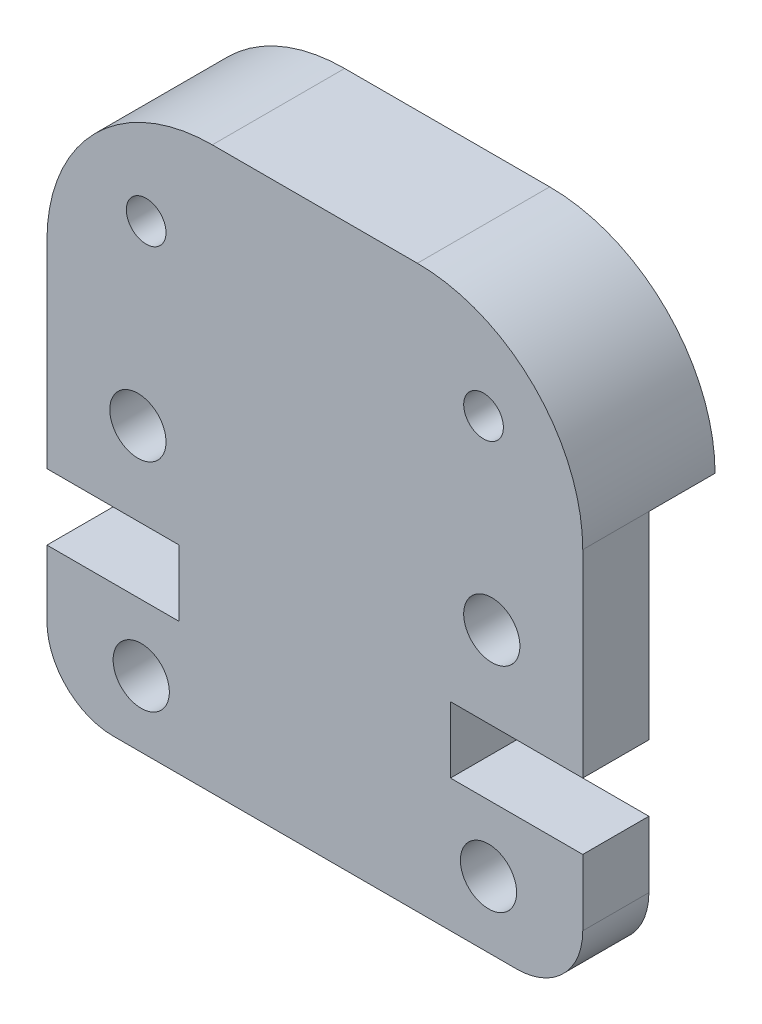
ISO-10303-21;
HEADER;
FILE_DESCRIPTION(('STEP AP214'),'2;1');
FILE_NAME('part.step','',(''),(''),'','','');
FILE_SCHEMA(('AUTOMOTIVE_DESIGN { 1 0 10303 214 1 1 1 1 }'));
ENDSEC;
DATA;
#1=APPLICATION_CONTEXT('core data for automotive mechanical design processes');
#2=APPLICATION_PROTOCOL_DEFINITION('international standard','automotive_design',2000,#1);
#3=PRODUCT_CONTEXT('',#1,'mechanical');
#4=PRODUCT('Part','Part','',(#3));
#5=PRODUCT_RELATED_PRODUCT_CATEGORY('part','',(#4));
#6=PRODUCT_DEFINITION_FORMATION('','',#4);
#7=PRODUCT_DEFINITION_CONTEXT('part definition',#1,'design');
#8=PRODUCT_DEFINITION('design','',#6,#7);
#9=PRODUCT_DEFINITION_SHAPE('','',#8);
#10=(LENGTH_UNIT() NAMED_UNIT(*) SI_UNIT(.MILLI.,.METRE.));
#11=(NAMED_UNIT(*) PLANE_ANGLE_UNIT() SI_UNIT($,.RADIAN.));
#12=(NAMED_UNIT(*) SI_UNIT($,.STERADIAN.) SOLID_ANGLE_UNIT());
#13=UNCERTAINTY_MEASURE_WITH_UNIT(LENGTH_MEASURE(1.E-05),#10,'distance_accuracy_value','');
#14=(GEOMETRIC_REPRESENTATION_CONTEXT(3) GLOBAL_UNCERTAINTY_ASSIGNED_CONTEXT((#13)) GLOBAL_UNIT_ASSIGNED_CONTEXT((#10,
#11,#12)) REPRESENTATION_CONTEXT('',''));
#15=CARTESIAN_POINT('',(0.,0.,0.));
#16=DIRECTION('',(0.,0.,1.));
#17=DIRECTION('',(1.,0.,0.));
#18=AXIS2_PLACEMENT_3D('',#15,#16,#17);
#19=CARTESIAN_POINT('',(-3.09999999999862,11.9799999999986,0.));
#20=DIRECTION('',(0.,0.,-1.));
#21=DIRECTION('',(-1.,0.,0.));
#22=AXIS2_PLACEMENT_3D('',#19,#20,#21);
#23=PLANE('',#22);
#24=CARTESIAN_POINT('',(-5.09999999999842,13.9799999999999,0.));
#25=DIRECTION('',(0.,0.,1.));
#26=DIRECTION('',(-1.,0.,0.));
#27=AXIS2_PLACEMENT_3D('',#24,#25,#26);
#28=CIRCLE('',#27,0.6);
#29=CARTESIAN_POINT('',(-5.69999999999843,13.9799999999999,0.));
#30=VERTEX_POINT('',#29);
#31=EDGE_CURVE('E276',#30,#30,#28,.T.);
#32=ORIENTED_EDGE('',*,*,#31,.T.);
#33=EDGE_LOOP('',(#32));
#34=FACE_BOUND('',#33,.T.);
#35=CARTESIAN_POINT('',(5.09999999999843,13.9799999999999,0.));
#36=DIRECTION('',(0.,0.,1.));
#37=DIRECTION('',(1.,0.,0.));
#38=AXIS2_PLACEMENT_3D('',#35,#36,#37);
#39=CIRCLE('',#38,0.6);
#40=CARTESIAN_POINT('',(5.69999999999843,13.9799999999999,0.));
#41=VERTEX_POINT('',#40);
#42=EDGE_CURVE('E264',#41,#41,#39,.T.);
#43=ORIENTED_EDGE('',*,*,#42,.T.);
#44=EDGE_LOOP('',(#43));
#45=FACE_BOUND('',#44,.T.);
#46=CARTESIAN_POINT('',(3.09999999999862,11.9799999999986,0.));
#47=DIRECTION('',(0.,0.,1.));
#48=DIRECTION('',(1.,0.,0.));
#49=AXIS2_PLACEMENT_3D('',#46,#47,#48);
#50=CIRCLE('',#49,5.00000000000135);
#51=CARTESIAN_POINT('',(8.09999999999997,11.9799999999986,0.));
#52=VERTEX_POINT('',#51);
#53=CARTESIAN_POINT('',(3.09999999999862,16.98,0.));
#54=VERTEX_POINT('',#53);
#55=EDGE_CURVE('E68',#52,#54,#50,.T.);
#56=ORIENTED_EDGE('',*,*,#55,.F.);
#57=DIRECTION('',(-1.,0.,0.));
#58=VECTOR('',#57,1.);
#59=CARTESIAN_POINT('',(8.09999999999997,11.9799999999986,0.));
#60=LINE('',#59,#58);
#61=CARTESIAN_POINT('',(-8.09999999999997,11.9799999999986,0.));
#62=VERTEX_POINT('',#61);
#63=EDGE_CURVE('E216',#52,#62,#60,.T.);
#64=ORIENTED_EDGE('',*,*,#63,.T.);
#65=CARTESIAN_POINT('',(-3.09999999999862,11.9799999999986,0.));
#66=DIRECTION('',(0.,0.,1.));
#67=DIRECTION('',(-1.,0.,0.));
#68=AXIS2_PLACEMENT_3D('',#65,#66,#67);
#69=CIRCLE('',#68,5.00000000000136);
#70=CARTESIAN_POINT('',(-3.09999999999862,16.98,0.));
#71=VERTEX_POINT('',#70);
#72=EDGE_CURVE('E149',#71,#62,#69,.T.);
#73=ORIENTED_EDGE('',*,*,#72,.F.);
#74=DIRECTION('',(-1.,0.,0.));
#75=VECTOR('',#74,1.);
#76=CARTESIAN_POINT('',(3.09999999999862,16.98,0.));
#77=LINE('',#76,#75);
#78=EDGE_CURVE('E74',#54,#71,#77,.T.);
#79=ORIENTED_EDGE('',*,*,#78,.F.);
#80=EDGE_LOOP('',(#56,#64,#73,#79));
#81=FACE_BOUND('',#80,.T.);
#82=ADVANCED_FACE('F35',(#34,#45,#81),#23,.T.);
#83=CARTESIAN_POINT('',(-3.09999999999862,11.9799999999986,4.));
#84=DIRECTION('',(0.,0.,-1.));
#85=DIRECTION('',(-1.,0.,0.));
#86=AXIS2_PLACEMENT_3D('',#83,#84,#85);
#87=PLANE('',#86);
#88=CARTESIAN_POINT('',(5.09999999999843,13.9799999999999,4.));
#89=DIRECTION('',(0.,0.,1.));
#90=DIRECTION('',(1.,0.,0.));
#91=AXIS2_PLACEMENT_3D('',#88,#89,#90);
#92=CIRCLE('',#91,0.6);
#93=CARTESIAN_POINT('',(5.69999999999843,13.9799999999999,4.));
#94=VERTEX_POINT('',#93);
#95=EDGE_CURVE('E265',#94,#94,#92,.T.);
#96=ORIENTED_EDGE('',*,*,#95,.F.);
#97=EDGE_LOOP('',(#96));
#98=FACE_BOUND('',#97,.T.);
#99=CARTESIAN_POINT('',(-5.34999999999997,8.50000000000221,4.));
#100=DIRECTION('',(0.,0.,1.));
#101=DIRECTION('',(-1.,0.,0.));
#102=AXIS2_PLACEMENT_3D('',#99,#100,#101);
#103=CIRCLE('',#102,0.85);
#104=CARTESIAN_POINT('',(-6.19999999999997,8.50000000000221,4.));
#105=VERTEX_POINT('',#104);
#106=EDGE_CURVE('E273',#105,#105,#103,.T.);
#107=ORIENTED_EDGE('',*,*,#106,.F.);
#108=EDGE_LOOP('',(#107));
#109=FACE_BOUND('',#108,.T.);
#110=CARTESIAN_POINT('',(-5.25,1.99999999999997,4.));
#111=DIRECTION('',(0.,0.,1.));
#112=DIRECTION('',(-1.,0.,0.));
#113=AXIS2_PLACEMENT_3D('',#110,#111,#112);
#114=CIRCLE('',#113,0.85);
#115=CARTESIAN_POINT('',(-6.1,1.99999999999997,4.));
#116=VERTEX_POINT('',#115);
#117=EDGE_CURVE('E152',#116,#116,#114,.T.);
#118=ORIENTED_EDGE('',*,*,#117,.F.);
#119=EDGE_LOOP('',(#118));
#120=FACE_BOUND('',#119,.T.);
#121=CARTESIAN_POINT('',(-3.09999999999862,11.9799999999986,4.));
#122=DIRECTION('',(0.,0.,1.));
#123=DIRECTION('',(-1.,0.,0.));
#124=AXIS2_PLACEMENT_3D('',#121,#122,#123);
#125=CIRCLE('',#124,5.00000000000136);
#126=CARTESIAN_POINT('',(-3.09999999999862,16.98,4.));
#127=VERTEX_POINT('',#126);
#128=CARTESIAN_POINT('',(-8.09999999999997,11.9799999999986,4.));
#129=VERTEX_POINT('',#128);
#130=EDGE_CURVE('E155',#127,#129,#125,.T.);
#131=ORIENTED_EDGE('',*,*,#130,.T.);
#132=DIRECTION('',(0.,-1.,0.));
#133=VECTOR('',#132,1.);
#134=CARTESIAN_POINT('',(-8.09999999999997,11.9799999999986,4.));
#135=LINE('',#134,#133);
#136=CARTESIAN_POINT('',(-8.09999999999997,5.99999999999993,4.));
#137=VERTEX_POINT('',#136);
#138=EDGE_CURVE('E82',#129,#137,#135,.T.);
#139=ORIENTED_EDGE('',*,*,#138,.T.);
#140=DIRECTION('',(1.,0.,0.));
#141=VECTOR('',#140,1.);
#142=CARTESIAN_POINT('',(-8.09999999999997,5.99999999999993,4.));
#143=LINE('',#142,#141);
#144=CARTESIAN_POINT('',(-4.10000000000002,5.99999999999993,4.));
#145=VERTEX_POINT('',#144);
#146=EDGE_CURVE('E198',#137,#145,#143,.T.);
#147=ORIENTED_EDGE('',*,*,#146,.T.);
#148=DIRECTION('',(0.,-1.,0.));
#149=VECTOR('',#148,1.);
#150=CARTESIAN_POINT('',(-4.10000000000002,5.99999999999993,4.));
#151=LINE('',#150,#149);
#152=CARTESIAN_POINT('',(-4.10000000000002,3.99999999999995,4.));
#153=VERTEX_POINT('',#152);
#154=EDGE_CURVE('E287',#145,#153,#151,.T.);
#155=ORIENTED_EDGE('',*,*,#154,.T.);
#156=DIRECTION('',(-1.,0.,0.));
#157=VECTOR('',#156,1.);
#158=CARTESIAN_POINT('',(-4.10000000000002,3.99999999999995,4.));
#159=LINE('',#158,#157);
#160=CARTESIAN_POINT('',(-8.09999999999997,3.99999999999995,4.));
#161=VERTEX_POINT('',#160);
#162=EDGE_CURVE('E289',#153,#161,#159,.T.);
#163=ORIENTED_EDGE('',*,*,#162,.T.);
#164=DIRECTION('',(0.,-1.,0.));
#165=VECTOR('',#164,1.);
#166=CARTESIAN_POINT('',(-8.09999999999997,1.99999999999997,4.));
#167=LINE('',#166,#165);
#168=CARTESIAN_POINT('',(-8.09999999999997,1.99999999999997,4.));
#169=VERTEX_POINT('',#168);
#170=EDGE_CURVE('E291',#161,#169,#167,.T.);
#171=ORIENTED_EDGE('',*,*,#170,.T.);
#172=CARTESIAN_POINT('',(-6.1,1.99999999999997,4.));
#173=DIRECTION('',(0.,0.,1.));
#174=DIRECTION('',(-1.,0.,0.));
#175=AXIS2_PLACEMENT_3D('',#172,#173,#174);
#176=CIRCLE('',#175,1.99999999999998);
#177=CARTESIAN_POINT('',(-6.09999999999999,0.,4.));
#178=VERTEX_POINT('',#177);
#179=EDGE_CURVE('E293',#169,#178,#176,.T.);
#180=ORIENTED_EDGE('',*,*,#179,.T.);
#181=DIRECTION('',(1.,0.,0.));
#182=VECTOR('',#181,1.);
#183=CARTESIAN_POINT('',(6.1,0.,4.));
#184=LINE('',#183,#182);
#185=CARTESIAN_POINT('',(6.1,0.,4.));
#186=VERTEX_POINT('',#185);
#187=EDGE_CURVE('E295',#178,#186,#184,.T.);
#188=ORIENTED_EDGE('',*,*,#187,.T.);
#189=CARTESIAN_POINT('',(6.1,1.99999999999998,4.));
#190=DIRECTION('',(0.,0.,1.));
#191=DIRECTION('',(1.,0.,0.));
#192=AXIS2_PLACEMENT_3D('',#189,#190,#191);
#193=CIRCLE('',#192,1.99999999999998);
#194=CARTESIAN_POINT('',(8.09999999999997,1.99999999999998,4.));
#195=VERTEX_POINT('',#194);
#196=EDGE_CURVE('E297',#186,#195,#193,.T.);
#197=ORIENTED_EDGE('',*,*,#196,.T.);
#198=DIRECTION('',(0.,1.,0.));
#199=VECTOR('',#198,1.);
#200=CARTESIAN_POINT('',(8.09999999999997,1.99999999999998,4.));
#201=LINE('',#200,#199);
#202=CARTESIAN_POINT('',(8.09999999999997,3.99999999999995,4.));
#203=VERTEX_POINT('',#202);
#204=EDGE_CURVE('E299',#195,#203,#201,.T.);
#205=ORIENTED_EDGE('',*,*,#204,.T.);
#206=DIRECTION('',(-1.,0.,0.));
#207=VECTOR('',#206,1.);
#208=CARTESIAN_POINT('',(4.10000000000002,3.99999999999995,4.));
#209=LINE('',#208,#207);
#210=CARTESIAN_POINT('',(4.10000000000002,3.99999999999995,4.));
#211=VERTEX_POINT('',#210);
#212=EDGE_CURVE('E301',#203,#211,#209,.T.);
#213=ORIENTED_EDGE('',*,*,#212,.T.);
#214=DIRECTION('',(0.,1.,0.));
#215=VECTOR('',#214,1.);
#216=CARTESIAN_POINT('',(4.10000000000002,5.99999999999993,4.));
#217=LINE('',#216,#215);
#218=CARTESIAN_POINT('',(4.10000000000002,5.99999999999993,4.));
#219=VERTEX_POINT('',#218);
#220=EDGE_CURVE('E303',#211,#219,#217,.T.);
#221=ORIENTED_EDGE('',*,*,#220,.T.);
#222=DIRECTION('',(1.,0.,0.));
#223=VECTOR('',#222,1.);
#224=CARTESIAN_POINT('',(8.09999999999997,5.99999999999993,4.));
#225=LINE('',#224,#223);
#226=CARTESIAN_POINT('',(8.09999999999997,5.99999999999993,4.));
#227=VERTEX_POINT('',#226);
#228=EDGE_CURVE('E128',#219,#227,#225,.T.);
#229=ORIENTED_EDGE('',*,*,#228,.T.);
#230=DIRECTION('',(0.,1.,0.));
#231=VECTOR('',#230,1.);
#232=CARTESIAN_POINT('',(8.09999999999997,11.9799999999986,4.));
#233=LINE('',#232,#231);
#234=CARTESIAN_POINT('',(8.09999999999997,11.9799999999986,4.));
#235=VERTEX_POINT('',#234);
#236=EDGE_CURVE('E121',#227,#235,#233,.T.);
#237=ORIENTED_EDGE('',*,*,#236,.T.);
#238=CARTESIAN_POINT('',(3.09999999999862,11.9799999999986,4.));
#239=DIRECTION('',(0.,0.,1.));
#240=DIRECTION('',(1.,0.,0.));
#241=AXIS2_PLACEMENT_3D('',#238,#239,#240);
#242=CIRCLE('',#241,5.00000000000135);
#243=CARTESIAN_POINT('',(3.09999999999862,16.98,4.));
#244=VERTEX_POINT('',#243);
#245=EDGE_CURVE('E126',#235,#244,#242,.T.);
#246=ORIENTED_EDGE('',*,*,#245,.T.);
#247=DIRECTION('',(-1.,0.,0.));
#248=VECTOR('',#247,1.);
#249=CARTESIAN_POINT('',(3.09999999999862,16.98,4.));
#250=LINE('',#249,#248);
#251=EDGE_CURVE('E53',#244,#127,#250,.T.);
#252=ORIENTED_EDGE('',*,*,#251,.T.);
#253=EDGE_LOOP('',(#131,#139,#147,#155,#163,#171,#180,#188,#197,#205,#213,#221,#229,#237,#246,#252));
#254=FACE_BOUND('',#253,.T.);
#255=CARTESIAN_POINT('',(-5.09999999999842,13.9799999999999,4.));
#256=DIRECTION('',(0.,0.,1.));
#257=DIRECTION('',(-1.,0.,0.));
#258=AXIS2_PLACEMENT_3D('',#255,#256,#257);
#259=CIRCLE('',#258,0.6);
#260=CARTESIAN_POINT('',(-5.69999999999843,13.9799999999999,4.));
#261=VERTEX_POINT('',#260);
#262=EDGE_CURVE('E277',#261,#261,#259,.T.);
#263=ORIENTED_EDGE('',*,*,#262,.F.);
#264=EDGE_LOOP('',(#263));
#265=FACE_BOUND('',#264,.T.);
#266=CARTESIAN_POINT('',(5.34999999999998,8.50000000000221,4.));
#267=DIRECTION('',(0.,0.,1.));
#268=DIRECTION('',(1.,0.,0.));
#269=AXIS2_PLACEMENT_3D('',#266,#267,#268);
#270=CIRCLE('',#269,0.85);
#271=CARTESIAN_POINT('',(6.19999999999998,8.50000000000221,4.));
#272=VERTEX_POINT('',#271);
#273=EDGE_CURVE('E268',#272,#272,#270,.T.);
#274=ORIENTED_EDGE('',*,*,#273,.F.);
#275=EDGE_LOOP('',(#274));
#276=FACE_BOUND('',#275,.T.);
#277=CARTESIAN_POINT('',(5.25,1.99999999999998,4.));
#278=DIRECTION('',(0.,0.,1.));
#279=DIRECTION('',(1.,0.,0.));
#280=AXIS2_PLACEMENT_3D('',#277,#278,#279);
#281=CIRCLE('',#280,0.85);
#282=CARTESIAN_POINT('',(6.1,1.99999999999998,4.));
#283=VERTEX_POINT('',#282);
#284=EDGE_CURVE('E261',#283,#283,#281,.T.);
#285=ORIENTED_EDGE('',*,*,#284,.F.);
#286=EDGE_LOOP('',(#285));
#287=FACE_BOUND('',#286,.T.);
#288=ADVANCED_FACE('F123',(#98,#109,#120,#254,#265,#276,#287),#87,.F.);
#289=CARTESIAN_POINT('',(-3.09999999999862,11.9799999999986,4.));
#290=DIRECTION('',(0.,0.,-1.));
#291=DIRECTION('',(-1.,0.,0.));
#292=AXIS2_PLACEMENT_3D('',#289,#290,#291);
#293=CYLINDRICAL_SURFACE('',#292,5.00000000000136);
#294=ORIENTED_EDGE('',*,*,#72,.T.);
#295=DIRECTION('',(0.,0.,-1.));
#296=VECTOR('',#295,1.);
#297=CARTESIAN_POINT('',(-8.09999999999997,11.9799999999986,2.));
#298=LINE('',#297,#296);
#299=CARTESIAN_POINT('',(-8.09999999999997,11.9799999999986,2.));
#300=VERTEX_POINT('',#299);
#301=EDGE_CURVE('E223',#300,#62,#298,.T.);
#302=ORIENTED_EDGE('',*,*,#301,.F.);
#303=DIRECTION('',(0.,0.,-1.));
#304=VECTOR('',#303,1.);
#305=CARTESIAN_POINT('',(-8.09999999999997,11.9799999999986,4.));
#306=LINE('',#305,#304);
#307=EDGE_CURVE('E11',#129,#300,#306,.T.);
#308=ORIENTED_EDGE('',*,*,#307,.F.);
#309=ORIENTED_EDGE('',*,*,#130,.F.);
#310=DIRECTION('',(0.,0.,-1.));
#311=VECTOR('',#310,1.);
#312=CARTESIAN_POINT('',(-3.09999999999862,16.98,4.));
#313=LINE('',#312,#311);
#314=EDGE_CURVE('E145',#127,#71,#313,.T.);
#315=ORIENTED_EDGE('',*,*,#314,.T.);
#316=EDGE_LOOP('',(#294,#302,#308,#309,#315));
#317=FACE_BOUND('',#316,.T.);
#318=ADVANCED_FACE('F37',(#317),#293,.T.);
#319=CARTESIAN_POINT('',(-8.09999999999997,11.9799999999986,4.));
#320=DIRECTION('',(1.,0.,0.));
#321=DIRECTION('',(0.,1.,0.));
#322=AXIS2_PLACEMENT_3D('',#319,#320,#321);
#323=PLANE('',#322);
#324=ORIENTED_EDGE('',*,*,#307,.T.);
#325=DIRECTION('',(0.,-1.,0.));
#326=VECTOR('',#325,1.);
#327=CARTESIAN_POINT('',(-8.09999999999997,11.9799999999986,2.));
#328=LINE('',#327,#326);
#329=CARTESIAN_POINT('',(-8.09999999999997,5.99999999999993,2.));
#330=VERTEX_POINT('',#329);
#331=EDGE_CURVE('E205',#300,#330,#328,.T.);
#332=ORIENTED_EDGE('',*,*,#331,.T.);
#333=DIRECTION('',(0.,0.,-1.));
#334=VECTOR('',#333,1.);
#335=CARTESIAN_POINT('',(-8.09999999999997,5.99999999999993,4.));
#336=LINE('',#335,#334);
#337=EDGE_CURVE('E45',#137,#330,#336,.T.);
#338=ORIENTED_EDGE('',*,*,#337,.F.);
#339=ORIENTED_EDGE('',*,*,#138,.F.);
#340=EDGE_LOOP('',(#324,#332,#338,#339));
#341=FACE_BOUND('',#340,.T.);
#342=ADVANCED_FACE('F203',(#341),#323,.F.);
#343=CARTESIAN_POINT('',(-8.09999999999997,5.99999999999993,4.));
#344=DIRECTION('',(0.,1.,0.));
#345=DIRECTION('',(-1.,0.,0.));
#346=AXIS2_PLACEMENT_3D('',#343,#344,#345);
#347=PLANE('',#346);
#348=ORIENTED_EDGE('',*,*,#337,.T.);
#349=DIRECTION('',(1.,0.,0.));
#350=VECTOR('',#349,1.);
#351=CARTESIAN_POINT('',(-8.09999999999997,5.99999999999993,2.));
#352=LINE('',#351,#350);
#353=CARTESIAN_POINT('',(-4.10000000000002,5.99999999999993,2.));
#354=VERTEX_POINT('',#353);
#355=EDGE_CURVE('E197',#330,#354,#352,.T.);
#356=ORIENTED_EDGE('',*,*,#355,.T.);
#357=DIRECTION('',(0.,0.,-1.));
#358=VECTOR('',#357,1.);
#359=CARTESIAN_POINT('',(-4.10000000000002,5.99999999999993,4.));
#360=LINE('',#359,#358);
#361=EDGE_CURVE('E186',#145,#354,#360,.T.);
#362=ORIENTED_EDGE('',*,*,#361,.F.);
#363=ORIENTED_EDGE('',*,*,#146,.F.);
#364=EDGE_LOOP('',(#348,#356,#362,#363));
#365=FACE_BOUND('',#364,.T.);
#366=ADVANCED_FACE('F194',(#365),#347,.F.);
#367=CARTESIAN_POINT('',(-4.10000000000002,5.99999999999993,4.));
#368=DIRECTION('',(1.,0.,0.));
#369=DIRECTION('',(0.,0.,-1.));
#370=AXIS2_PLACEMENT_3D('',#367,#368,#369);
#371=PLANE('',#370);
#372=ORIENTED_EDGE('',*,*,#361,.T.);
#373=DIRECTION('',(0.,-1.,0.));
#374=VECTOR('',#373,1.);
#375=CARTESIAN_POINT('',(-4.10000000000002,5.99999999999993,2.));
#376=LINE('',#375,#374);
#377=CARTESIAN_POINT('',(-4.10000000000002,3.99999999999995,2.));
#378=VERTEX_POINT('',#377);
#379=EDGE_CURVE('E257',#354,#378,#376,.T.);
#380=ORIENTED_EDGE('',*,*,#379,.T.);
#381=DIRECTION('',(0.,0.,-1.));
#382=VECTOR('',#381,1.);
#383=CARTESIAN_POINT('',(-4.10000000000002,3.99999999999995,4.));
#384=LINE('',#383,#382);
#385=EDGE_CURVE('E183',#153,#378,#384,.T.);
#386=ORIENTED_EDGE('',*,*,#385,.F.);
#387=ORIENTED_EDGE('',*,*,#154,.F.);
#388=EDGE_LOOP('',(#372,#380,#386,#387));
#389=FACE_BOUND('',#388,.T.);
#390=ADVANCED_FACE('F332',(#389),#371,.F.);
#391=CARTESIAN_POINT('',(-4.10000000000002,3.99999999999995,4.));
#392=DIRECTION('',(0.,-1.,0.));
#393=DIRECTION('',(1.,0.,0.));
#394=AXIS2_PLACEMENT_3D('',#391,#392,#393);
#395=PLANE('',#394);
#396=ORIENTED_EDGE('',*,*,#385,.T.);
#397=DIRECTION('',(-1.,0.,0.));
#398=VECTOR('',#397,1.);
#399=CARTESIAN_POINT('',(-4.10000000000002,3.99999999999995,2.));
#400=LINE('',#399,#398);
#401=CARTESIAN_POINT('',(-8.09999999999997,3.99999999999995,2.));
#402=VERTEX_POINT('',#401);
#403=EDGE_CURVE('E254',#378,#402,#400,.T.);
#404=ORIENTED_EDGE('',*,*,#403,.T.);
#405=DIRECTION('',(0.,0.,-1.));
#406=VECTOR('',#405,1.);
#407=CARTESIAN_POINT('',(-8.09999999999997,3.99999999999995,4.));
#408=LINE('',#407,#406);
#409=EDGE_CURVE('E180',#161,#402,#408,.T.);
#410=ORIENTED_EDGE('',*,*,#409,.F.);
#411=ORIENTED_EDGE('',*,*,#162,.F.);
#412=EDGE_LOOP('',(#396,#404,#410,#411));
#413=FACE_BOUND('',#412,.T.);
#414=ADVANCED_FACE('F336',(#413),#395,.F.);
#415=CARTESIAN_POINT('',(-8.09999999999997,1.99999999999997,4.));
#416=DIRECTION('',(1.,0.,0.));
#417=DIRECTION('',(0.,0.,-1.));
#418=AXIS2_PLACEMENT_3D('',#415,#416,#417);
#419=PLANE('',#418);
#420=ORIENTED_EDGE('',*,*,#409,.T.);
#421=CARTESIAN_POINT('',(-8.09999999999997,1.99999999999997,2.));
#422=VERTEX_POINT('',#421);
#423=EDGE_CURVE('E211',#402,#422,#328,.T.);
#424=ORIENTED_EDGE('',*,*,#423,.T.);
#425=DIRECTION('',(0.,0.,-1.));
#426=VECTOR('',#425,1.);
#427=CARTESIAN_POINT('',(-8.09999999999997,1.99999999999997,4.));
#428=LINE('',#427,#426);
#429=EDGE_CURVE('E177',#169,#422,#428,.T.);
#430=ORIENTED_EDGE('',*,*,#429,.F.);
#431=ORIENTED_EDGE('',*,*,#170,.F.);
#432=EDGE_LOOP('',(#420,#424,#430,#431));
#433=FACE_BOUND('',#432,.T.);
#434=ADVANCED_FACE('F392',(#433),#419,.F.);
#435=CARTESIAN_POINT('',(-6.1,1.99999999999997,4.));
#436=DIRECTION('',(0.,0.,-1.));
#437=DIRECTION('',(-1.,0.,0.));
#438=AXIS2_PLACEMENT_3D('',#435,#436,#437);
#439=CYLINDRICAL_SURFACE('',#438,1.99999999999998);
#440=ORIENTED_EDGE('',*,*,#429,.T.);
#441=CARTESIAN_POINT('',(-6.1,1.99999999999997,2.));
#442=DIRECTION('',(0.,0.,1.));
#443=DIRECTION('',(1.,0.,0.));
#444=AXIS2_PLACEMENT_3D('',#441,#442,#443);
#445=CIRCLE('',#444,1.99999999999998);
#446=CARTESIAN_POINT('',(-6.09999999999999,0.,2.));
#447=VERTEX_POINT('',#446);
#448=EDGE_CURVE('E251',#422,#447,#445,.T.);
#449=ORIENTED_EDGE('',*,*,#448,.T.);
#450=DIRECTION('',(0.,0.,-1.));
#451=VECTOR('',#450,1.);
#452=CARTESIAN_POINT('',(-6.09999999999999,0.,4.));
#453=LINE('',#452,#451);
#454=EDGE_CURVE('E174',#178,#447,#453,.T.);
#455=ORIENTED_EDGE('',*,*,#454,.F.);
#456=ORIENTED_EDGE('',*,*,#179,.F.);
#457=EDGE_LOOP('',(#440,#449,#455,#456));
#458=FACE_BOUND('',#457,.T.);
#459=ADVANCED_FACE('F388',(#458),#439,.T.);
#460=CARTESIAN_POINT('',(6.1,0.,4.));
#461=DIRECTION('',(0.,1.,0.));
#462=DIRECTION('',(-1.,0.,0.));
#463=AXIS2_PLACEMENT_3D('',#460,#461,#462);
#464=PLANE('',#463);
#465=ORIENTED_EDGE('',*,*,#454,.T.);
#466=DIRECTION('',(1.,0.,0.));
#467=VECTOR('',#466,1.);
#468=CARTESIAN_POINT('',(-8.09999999999997,0.,2.));
#469=LINE('',#468,#467);
#470=CARTESIAN_POINT('',(6.1,0.,2.));
#471=VERTEX_POINT('',#470);
#472=EDGE_CURVE('E210',#447,#471,#469,.T.);
#473=ORIENTED_EDGE('',*,*,#472,.T.);
#474=DIRECTION('',(0.,0.,-1.));
#475=VECTOR('',#474,1.);
#476=CARTESIAN_POINT('',(6.1,0.,4.));
#477=LINE('',#476,#475);
#478=EDGE_CURVE('E171',#186,#471,#477,.T.);
#479=ORIENTED_EDGE('',*,*,#478,.F.);
#480=ORIENTED_EDGE('',*,*,#187,.F.);
#481=EDGE_LOOP('',(#465,#473,#479,#480));
#482=FACE_BOUND('',#481,.T.);
#483=ADVANCED_FACE('F384',(#482),#464,.F.);
#484=CARTESIAN_POINT('',(6.1,1.99999999999998,4.));
#485=DIRECTION('',(0.,0.,-1.));
#486=DIRECTION('',(-1.,0.,0.));
#487=AXIS2_PLACEMENT_3D('',#484,#485,#486);
#488=CYLINDRICAL_SURFACE('',#487,1.99999999999998);
#489=ORIENTED_EDGE('',*,*,#478,.T.);
#490=CARTESIAN_POINT('',(6.1,1.99999999999998,2.));
#491=DIRECTION('',(0.,0.,1.));
#492=DIRECTION('',(1.,0.,0.));
#493=AXIS2_PLACEMENT_3D('',#490,#491,#492);
#494=CIRCLE('',#493,1.99999999999998);
#495=CARTESIAN_POINT('',(8.09999999999997,1.99999999999998,2.));
#496=VERTEX_POINT('',#495);
#497=EDGE_CURVE('E248',#471,#496,#494,.T.);
#498=ORIENTED_EDGE('',*,*,#497,.T.);
#499=DIRECTION('',(0.,0.,-1.));
#500=VECTOR('',#499,1.);
#501=CARTESIAN_POINT('',(8.09999999999997,1.99999999999998,4.));
#502=LINE('',#501,#500);
#503=EDGE_CURVE('E168',#195,#496,#502,.T.);
#504=ORIENTED_EDGE('',*,*,#503,.F.);
#505=ORIENTED_EDGE('',*,*,#196,.F.);
#506=EDGE_LOOP('',(#489,#498,#504,#505));
#507=FACE_BOUND('',#506,.T.);
#508=ADVANCED_FACE('F380',(#507),#488,.T.);
#509=CARTESIAN_POINT('',(8.09999999999997,1.99999999999998,4.));
#510=DIRECTION('',(-1.,0.,0.));
#511=DIRECTION('',(0.,0.,1.));
#512=AXIS2_PLACEMENT_3D('',#509,#510,#511);
#513=PLANE('',#512);
#514=ORIENTED_EDGE('',*,*,#503,.T.);
#515=DIRECTION('',(0.,1.,0.));
#516=VECTOR('',#515,1.);
#517=CARTESIAN_POINT('',(8.09999999999997,0.,2.));
#518=LINE('',#517,#516);
#519=CARTESIAN_POINT('',(8.09999999999997,3.99999999999995,2.));
#520=VERTEX_POINT('',#519);
#521=EDGE_CURVE('E219',#496,#520,#518,.T.);
#522=ORIENTED_EDGE('',*,*,#521,.T.);
#523=DIRECTION('',(0.,0.,-1.));
#524=VECTOR('',#523,1.);
#525=CARTESIAN_POINT('',(8.09999999999997,3.99999999999995,4.));
#526=LINE('',#525,#524);
#527=EDGE_CURVE('E165',#203,#520,#526,.T.);
#528=ORIENTED_EDGE('',*,*,#527,.F.);
#529=ORIENTED_EDGE('',*,*,#204,.F.);
#530=EDGE_LOOP('',(#514,#522,#528,#529));
#531=FACE_BOUND('',#530,.T.);
#532=ADVANCED_FACE('F376',(#531),#513,.F.);
#533=CARTESIAN_POINT('',(4.10000000000002,3.99999999999995,4.));
#534=DIRECTION('',(0.,-1.,0.));
#535=DIRECTION('',(0.,0.,-1.));
#536=AXIS2_PLACEMENT_3D('',#533,#534,#535);
#537=PLANE('',#536);
#538=ORIENTED_EDGE('',*,*,#527,.T.);
#539=DIRECTION('',(-1.,0.,0.));
#540=VECTOR('',#539,1.);
#541=CARTESIAN_POINT('',(4.10000000000002,3.99999999999995,2.));
#542=LINE('',#541,#540);
#543=CARTESIAN_POINT('',(4.10000000000002,3.99999999999995,2.));
#544=VERTEX_POINT('',#543);
#545=EDGE_CURVE('E245',#520,#544,#542,.T.);
#546=ORIENTED_EDGE('',*,*,#545,.T.);
#547=DIRECTION('',(0.,0.,-1.));
#548=VECTOR('',#547,1.);
#549=CARTESIAN_POINT('',(4.10000000000002,3.99999999999995,4.));
#550=LINE('',#549,#548);
#551=EDGE_CURVE('E162',#211,#544,#550,.T.);
#552=ORIENTED_EDGE('',*,*,#551,.F.);
#553=ORIENTED_EDGE('',*,*,#212,.F.);
#554=EDGE_LOOP('',(#538,#546,#552,#553));
#555=FACE_BOUND('',#554,.T.);
#556=ADVANCED_FACE('F373',(#555),#537,.F.);
#557=CARTESIAN_POINT('',(4.10000000000002,5.99999999999993,4.));
#558=DIRECTION('',(-1.,0.,0.));
#559=DIRECTION('',(0.,0.,1.));
#560=AXIS2_PLACEMENT_3D('',#557,#558,#559);
#561=PLANE('',#560);
#562=ORIENTED_EDGE('',*,*,#551,.T.);
#563=DIRECTION('',(0.,1.,0.));
#564=VECTOR('',#563,1.);
#565=CARTESIAN_POINT('',(4.10000000000002,5.99999999999993,2.));
#566=LINE('',#565,#564);
#567=CARTESIAN_POINT('',(4.10000000000002,5.99999999999993,2.));
#568=VERTEX_POINT('',#567);
#569=EDGE_CURVE('E242',#544,#568,#566,.T.);
#570=ORIENTED_EDGE('',*,*,#569,.T.);
#571=DIRECTION('',(0.,0.,-1.));
#572=VECTOR('',#571,1.);
#573=CARTESIAN_POINT('',(4.10000000000002,5.99999999999993,4.));
#574=LINE('',#573,#572);
#575=EDGE_CURVE('E159',#219,#568,#574,.T.);
#576=ORIENTED_EDGE('',*,*,#575,.F.);
#577=ORIENTED_EDGE('',*,*,#220,.F.);
#578=EDGE_LOOP('',(#562,#570,#576,#577));
#579=FACE_BOUND('',#578,.T.);
#580=ADVANCED_FACE('F309',(#579),#561,.F.);
#581=CARTESIAN_POINT('',(8.09999999999997,5.99999999999993,4.));
#582=DIRECTION('',(0.,1.,0.));
#583=DIRECTION('',(0.,0.,1.));
#584=AXIS2_PLACEMENT_3D('',#581,#582,#583);
#585=PLANE('',#584);
#586=ORIENTED_EDGE('',*,*,#575,.T.);
#587=DIRECTION('',(1.,0.,0.));
#588=VECTOR('',#587,1.);
#589=CARTESIAN_POINT('',(8.09999999999997,5.99999999999993,2.));
#590=LINE('',#589,#588);
#591=CARTESIAN_POINT('',(8.09999999999997,5.99999999999993,2.));
#592=VERTEX_POINT('',#591);
#593=EDGE_CURVE('E239',#568,#592,#590,.T.);
#594=ORIENTED_EDGE('',*,*,#593,.T.);
#595=DIRECTION('',(0.,0.,-1.));
#596=VECTOR('',#595,1.);
#597=CARTESIAN_POINT('',(8.09999999999997,5.99999999999993,4.));
#598=LINE('',#597,#596);
#599=EDGE_CURVE('E140',#227,#592,#598,.T.);
#600=ORIENTED_EDGE('',*,*,#599,.F.);
#601=ORIENTED_EDGE('',*,*,#228,.F.);
#602=EDGE_LOOP('',(#586,#594,#600,#601));
#603=FACE_BOUND('',#602,.T.);
#604=ADVANCED_FACE('F313',(#603),#585,.F.);
#605=CARTESIAN_POINT('',(8.09999999999997,11.9799999999986,4.));
#606=DIRECTION('',(-1.,0.,0.));
#607=DIRECTION('',(0.,0.,1.));
#608=AXIS2_PLACEMENT_3D('',#605,#606,#607);
#609=PLANE('',#608);
#610=ORIENTED_EDGE('',*,*,#599,.T.);
#611=CARTESIAN_POINT('',(8.09999999999997,11.9799999999986,2.));
#612=VERTEX_POINT('',#611);
#613=EDGE_CURVE('E139',#592,#612,#518,.T.);
#614=ORIENTED_EDGE('',*,*,#613,.T.);
#615=DIRECTION('',(0.,0.,-1.));
#616=VECTOR('',#615,1.);
#617=CARTESIAN_POINT('',(8.09999999999997,11.9799999999986,4.));
#618=LINE('',#617,#616);
#619=EDGE_CURVE('E135',#235,#612,#618,.T.);
#620=ORIENTED_EDGE('',*,*,#619,.F.);
#621=ORIENTED_EDGE('',*,*,#236,.F.);
#622=EDGE_LOOP('',(#610,#614,#620,#621));
#623=FACE_BOUND('',#622,.T.);
#624=ADVANCED_FACE('F136',(#623),#609,.F.);
#625=CARTESIAN_POINT('',(3.09999999999862,11.9799999999986,4.));
#626=DIRECTION('',(0.,0.,-1.));
#627=DIRECTION('',(-1.,0.,0.));
#628=AXIS2_PLACEMENT_3D('',#625,#626,#627);
#629=CYLINDRICAL_SURFACE('',#628,5.00000000000135);
#630=ORIENTED_EDGE('',*,*,#55,.T.);
#631=DIRECTION('',(0.,0.,-1.));
#632=VECTOR('',#631,1.);
#633=CARTESIAN_POINT('',(3.09999999999862,16.98,4.));
#634=LINE('',#633,#632);
#635=EDGE_CURVE('E141',#244,#54,#634,.T.);
#636=ORIENTED_EDGE('',*,*,#635,.F.);
#637=ORIENTED_EDGE('',*,*,#245,.F.);
#638=ORIENTED_EDGE('',*,*,#619,.T.);
#639=DIRECTION('',(0.,0.,-1.));
#640=VECTOR('',#639,1.);
#641=CARTESIAN_POINT('',(8.09999999999997,11.9799999999986,2.));
#642=LINE('',#641,#640);
#643=EDGE_CURVE('E228',#612,#52,#642,.T.);
#644=ORIENTED_EDGE('',*,*,#643,.T.);
#645=EDGE_LOOP('',(#630,#636,#637,#638,#644));
#646=FACE_BOUND('',#645,.T.);
#647=ADVANCED_FACE('F143',(#646),#629,.T.);
#648=CARTESIAN_POINT('',(3.09999999999862,16.98,4.));
#649=DIRECTION('',(0.,-1.,0.));
#650=DIRECTION('',(0.,0.,-1.));
#651=AXIS2_PLACEMENT_3D('',#648,#649,#650);
#652=PLANE('',#651);
#653=ORIENTED_EDGE('',*,*,#78,.T.);
#654=ORIENTED_EDGE('',*,*,#314,.F.);
#655=ORIENTED_EDGE('',*,*,#251,.F.);
#656=ORIENTED_EDGE('',*,*,#635,.T.);
#657=EDGE_LOOP('',(#653,#654,#655,#656));
#658=FACE_BOUND('',#657,.T.);
#659=ADVANCED_FACE('F361',(#658),#652,.F.);
#660=CARTESIAN_POINT('',(-5.25,1.99999999999997,4.));
#661=DIRECTION('',(0.,0.,-1.));
#662=DIRECTION('',(-1.,0.,0.));
#663=AXIS2_PLACEMENT_3D('',#660,#661,#662);
#664=CYLINDRICAL_SURFACE('',#663,0.85);
#665=CARTESIAN_POINT('',(-5.25,1.99999999999997,2.));
#666=DIRECTION('',(0.,0.,1.));
#667=DIRECTION('',(1.,0.,0.));
#668=AXIS2_PLACEMENT_3D('',#665,#666,#667);
#669=CIRCLE('',#668,0.85);
#670=CARTESIAN_POINT('',(-4.4,1.99999999999997,2.));
#671=VERTEX_POINT('',#670);
#672=EDGE_CURVE('E236',#671,#671,#669,.T.);
#673=ORIENTED_EDGE('',*,*,#672,.F.);
#674=EDGE_LOOP('',(#673));
#675=FACE_BOUND('',#674,.T.);
#676=ORIENTED_EDGE('',*,*,#117,.T.);
#677=EDGE_LOOP('',(#676));
#678=FACE_BOUND('',#677,.T.);
#679=ADVANCED_FACE('F364',(#675,#678),#664,.F.);
#680=CARTESIAN_POINT('',(-5.09999999999842,13.9799999999999,4.));
#681=DIRECTION('',(0.,0.,-1.));
#682=DIRECTION('',(-1.,0.,0.));
#683=AXIS2_PLACEMENT_3D('',#680,#681,#682);
#684=CYLINDRICAL_SURFACE('',#683,0.6);
#685=ORIENTED_EDGE('',*,*,#262,.T.);
#686=EDGE_LOOP('',(#685));
#687=FACE_BOUND('',#686,.T.);
#688=ORIENTED_EDGE('',*,*,#31,.F.);
#689=EDGE_LOOP('',(#688));
#690=FACE_BOUND('',#689,.T.);
#691=ADVANCED_FACE('F426',(#687,#690),#684,.F.);
#692=CARTESIAN_POINT('',(-5.34999999999997,8.50000000000221,4.));
#693=DIRECTION('',(0.,0.,-1.));
#694=DIRECTION('',(-1.,0.,0.));
#695=AXIS2_PLACEMENT_3D('',#692,#693,#694);
#696=CYLINDRICAL_SURFACE('',#695,0.85);
#697=CARTESIAN_POINT('',(-5.34999999999997,8.50000000000221,2.));
#698=DIRECTION('',(0.,0.,1.));
#699=DIRECTION('',(1.,0.,0.));
#700=AXIS2_PLACEMENT_3D('',#697,#698,#699);
#701=CIRCLE('',#700,0.85);
#702=CARTESIAN_POINT('',(-4.49999999999997,8.50000000000221,2.));
#703=VERTEX_POINT('',#702);
#704=EDGE_CURVE('E233',#703,#703,#701,.T.);
#705=ORIENTED_EDGE('',*,*,#704,.F.);
#706=EDGE_LOOP('',(#705));
#707=FACE_BOUND('',#706,.T.);
#708=ORIENTED_EDGE('',*,*,#106,.T.);
#709=EDGE_LOOP('',(#708));
#710=FACE_BOUND('',#709,.T.);
#711=ADVANCED_FACE('F431',(#707,#710),#696,.F.);
#712=CARTESIAN_POINT('',(5.34999999999998,8.50000000000221,4.));
#713=DIRECTION('',(0.,0.,-1.));
#714=DIRECTION('',(-1.,0.,0.));
#715=AXIS2_PLACEMENT_3D('',#712,#713,#714);
#716=CYLINDRICAL_SURFACE('',#715,0.85);
#717=CARTESIAN_POINT('',(5.34999999999998,8.50000000000221,2.));
#718=DIRECTION('',(0.,0.,1.));
#719=DIRECTION('',(1.,0.,0.));
#720=AXIS2_PLACEMENT_3D('',#717,#718,#719);
#721=CIRCLE('',#720,0.85);
#722=CARTESIAN_POINT('',(6.19999999999998,8.50000000000221,2.));
#723=VERTEX_POINT('',#722);
#724=EDGE_CURVE('E230',#723,#723,#721,.T.);
#725=ORIENTED_EDGE('',*,*,#724,.F.);
#726=EDGE_LOOP('',(#725));
#727=FACE_BOUND('',#726,.T.);
#728=ORIENTED_EDGE('',*,*,#273,.T.);
#729=EDGE_LOOP('',(#728));
#730=FACE_BOUND('',#729,.T.);
#731=ADVANCED_FACE('F444',(#727,#730),#716,.F.);
#732=CARTESIAN_POINT('',(5.09999999999843,13.9799999999999,4.));
#733=DIRECTION('',(0.,0.,-1.));
#734=DIRECTION('',(-1.,0.,0.));
#735=AXIS2_PLACEMENT_3D('',#732,#733,#734);
#736=CYLINDRICAL_SURFACE('',#735,0.6);
#737=ORIENTED_EDGE('',*,*,#95,.T.);
#738=EDGE_LOOP('',(#737));
#739=FACE_BOUND('',#738,.T.);
#740=ORIENTED_EDGE('',*,*,#42,.F.);
#741=EDGE_LOOP('',(#740));
#742=FACE_BOUND('',#741,.T.);
#743=ADVANCED_FACE('F439',(#739,#742),#736,.F.);
#744=CARTESIAN_POINT('',(5.25,1.99999999999998,4.));
#745=DIRECTION('',(0.,0.,-1.));
#746=DIRECTION('',(-1.,0.,0.));
#747=AXIS2_PLACEMENT_3D('',#744,#745,#746);
#748=CYLINDRICAL_SURFACE('',#747,0.85);
#749=CARTESIAN_POINT('',(5.25,1.99999999999998,2.));
#750=DIRECTION('',(0.,0.,1.));
#751=DIRECTION('',(1.,0.,0.));
#752=AXIS2_PLACEMENT_3D('',#749,#750,#751);
#753=CIRCLE('',#752,0.85);
#754=CARTESIAN_POINT('',(6.1,1.99999999999998,2.));
#755=VERTEX_POINT('',#754);
#756=EDGE_CURVE('E39',#755,#755,#753,.T.);
#757=ORIENTED_EDGE('',*,*,#756,.F.);
#758=EDGE_LOOP('',(#757));
#759=FACE_BOUND('',#758,.T.);
#760=ORIENTED_EDGE('',*,*,#284,.T.);
#761=EDGE_LOOP('',(#760));
#762=FACE_BOUND('',#761,.T.);
#763=ADVANCED_FACE('F443',(#759,#762),#748,.F.);
#764=CARTESIAN_POINT('',(0.,0.,2.));
#765=DIRECTION('',(0.,0.,1.));
#766=DIRECTION('',(1.,0.,0.));
#767=AXIS2_PLACEMENT_3D('',#764,#765,#766);
#768=PLANE('',#767);
#769=ORIENTED_EDGE('',*,*,#672,.T.);
#770=EDGE_LOOP('',(#769));
#771=FACE_BOUND('',#770,.T.);
#772=ORIENTED_EDGE('',*,*,#704,.T.);
#773=EDGE_LOOP('',(#772));
#774=FACE_BOUND('',#773,.T.);
#775=ORIENTED_EDGE('',*,*,#724,.T.);
#776=EDGE_LOOP('',(#775));
#777=FACE_BOUND('',#776,.T.);
#778=ORIENTED_EDGE('',*,*,#756,.T.);
#779=EDGE_LOOP('',(#778));
#780=FACE_BOUND('',#779,.T.);
#781=ORIENTED_EDGE('',*,*,#331,.F.);
#782=DIRECTION('',(-1.,0.,0.));
#783=VECTOR('',#782,1.);
#784=CARTESIAN_POINT('',(8.09999999999997,11.9799999999986,2.));
#785=LINE('',#784,#783);
#786=EDGE_CURVE('E220',#612,#300,#785,.T.);
#787=ORIENTED_EDGE('',*,*,#786,.F.);
#788=ORIENTED_EDGE('',*,*,#613,.F.);
#789=ORIENTED_EDGE('',*,*,#593,.F.);
#790=ORIENTED_EDGE('',*,*,#569,.F.);
#791=ORIENTED_EDGE('',*,*,#545,.F.);
#792=ORIENTED_EDGE('',*,*,#521,.F.);
#793=ORIENTED_EDGE('',*,*,#497,.F.);
#794=ORIENTED_EDGE('',*,*,#472,.F.);
#795=ORIENTED_EDGE('',*,*,#448,.F.);
#796=ORIENTED_EDGE('',*,*,#423,.F.);
#797=ORIENTED_EDGE('',*,*,#403,.F.);
#798=ORIENTED_EDGE('',*,*,#379,.F.);
#799=ORIENTED_EDGE('',*,*,#355,.F.);
#800=EDGE_LOOP('',(#781,#787,#788,#789,#790,#791,#792,#793,#794,#795,#796,#797,#798,#799));
#801=FACE_BOUND('',#800,.T.);
#802=ADVANCED_FACE('F329',(#771,#774,#777,#780,#801),#768,.F.);
#803=CARTESIAN_POINT('',(8.09999999999997,11.9799999999986,2.));
#804=DIRECTION('',(0.,-1.,0.));
#805=DIRECTION('',(1.,0.,0.));
#806=AXIS2_PLACEMENT_3D('',#803,#804,#805);
#807=PLANE('',#806);
#808=ORIENTED_EDGE('',*,*,#63,.F.);
#809=ORIENTED_EDGE('',*,*,#643,.F.);
#810=ORIENTED_EDGE('',*,*,#786,.T.);
#811=ORIENTED_EDGE('',*,*,#301,.T.);
#812=EDGE_LOOP('',(#808,#809,#810,#811));
#813=FACE_BOUND('',#812,.T.);
#814=ADVANCED_FACE('F346',(#813),#807,.T.);
#815=CLOSED_SHELL('',(#82,#288,#318,#342,#366,#390,#414,#434,#459,#483,#508,#532,#556,#580,#604,
#624,#647,#659,#679,#691,#711,#731,#743,#763,#802,#814));
#816=MANIFOLD_SOLID_BREP('B2',#815);
#817=ADVANCED_BREP_SHAPE_REPRESENTATION('',(#18,#816),#14);
#818=SHAPE_DEFINITION_REPRESENTATION(#9,#817);
ENDSEC;
END-ISO-10303-21;
